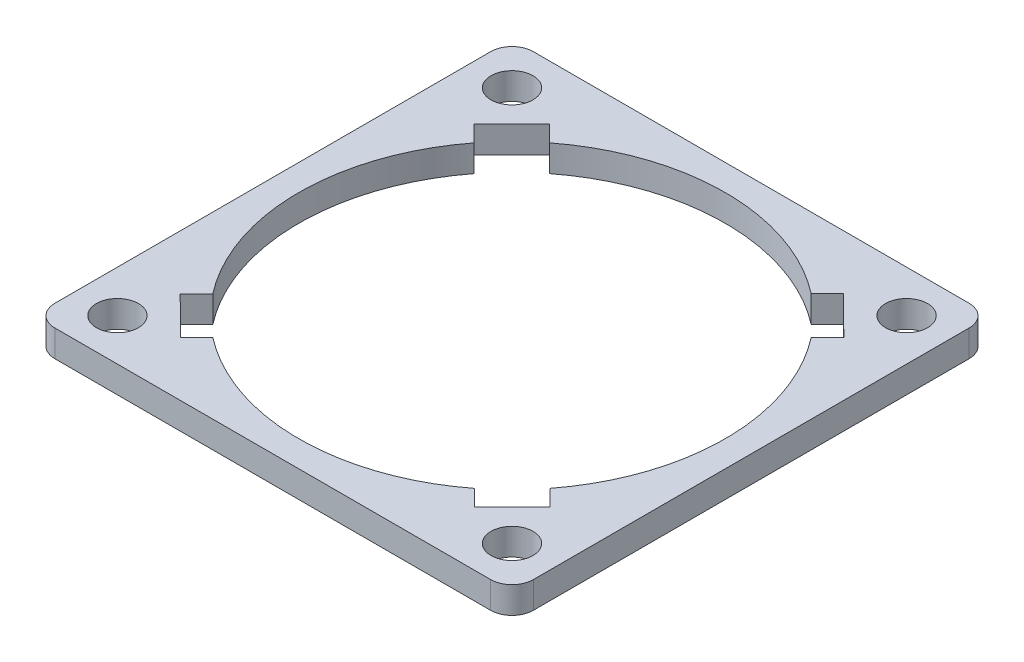
ISO-10303-21;
HEADER;
FILE_DESCRIPTION(('STEP AP214'),'2;1');
FILE_NAME('part.step','',(''),(''),'','','');
FILE_SCHEMA(('AUTOMOTIVE_DESIGN { 1 0 10303 214 1 1 1 1 }'));
ENDSEC;
DATA;
#1=APPLICATION_CONTEXT('core data for automotive mechanical design processes');
#2=APPLICATION_PROTOCOL_DEFINITION('international standard','automotive_design',2000,#1);
#3=PRODUCT_CONTEXT('',#1,'mechanical');
#4=PRODUCT('Part','Part','',(#3));
#5=PRODUCT_RELATED_PRODUCT_CATEGORY('part','',(#4));
#6=PRODUCT_DEFINITION_FORMATION('','',#4);
#7=PRODUCT_DEFINITION_CONTEXT('part definition',#1,'design');
#8=PRODUCT_DEFINITION('design','',#6,#7);
#9=PRODUCT_DEFINITION_SHAPE('','',#8);
#10=(LENGTH_UNIT() NAMED_UNIT(*) SI_UNIT(.MILLI.,.METRE.));
#11=(NAMED_UNIT(*) PLANE_ANGLE_UNIT() SI_UNIT($,.RADIAN.));
#12=(NAMED_UNIT(*) SI_UNIT($,.STERADIAN.) SOLID_ANGLE_UNIT());
#13=UNCERTAINTY_MEASURE_WITH_UNIT(LENGTH_MEASURE(1.E-05),#10,'distance_accuracy_value','');
#14=(GEOMETRIC_REPRESENTATION_CONTEXT(3) GLOBAL_UNCERTAINTY_ASSIGNED_CONTEXT((#13)) GLOBAL_UNIT_ASSIGNED_CONTEXT((#10,
#11,#12)) REPRESENTATION_CONTEXT('',''));
#15=CARTESIAN_POINT('',(0.,0.,0.));
#16=DIRECTION('',(0.,0.,1.));
#17=DIRECTION('',(1.,0.,0.));
#18=AXIS2_PLACEMENT_3D('',#15,#16,#17);
#19=CARTESIAN_POINT('',(25.9599938,3.175,-25.9599938));
#20=DIRECTION('',(0.,1.,0.));
#21=DIRECTION('',(0.,0.,1.));
#22=AXIS2_PLACEMENT_3D('',#19,#20,#21);
#23=PLANE('',#22);
#24=CARTESIAN_POINT('',(23.5000038000013,3.175,23.5000037999987));
#25=DIRECTION('',(0.,1.,0.));
#26=DIRECTION('',(0.,0.,1.));
#27=AXIS2_PLACEMENT_3D('',#24,#25,#26);
#28=CIRCLE('',#27,2.49999500000186);
#29=CARTESIAN_POINT('',(23.5000038000013,3.175,25.9999988000005));
#30=VERTEX_POINT('',#29);
#31=EDGE_CURVE('E535',#30,#30,#28,.T.);
#32=ORIENTED_EDGE('',*,*,#31,.F.);
#33=EDGE_LOOP('',(#32));
#34=FACE_BOUND('',#33,.T.);
#35=DIRECTION('',(-0.70756591619888,0.,-0.706647347857218));
#36=VECTOR('',#35,1.);
#37=CARTESIAN_POINT('',(-15.5876085360687,3.175,-20.0545870096165));
#38=LINE('',#37,#36);
#39=CARTESIAN_POINT('',(-15.5876085360687,3.175,-20.0545870096165));
#40=VERTEX_POINT('',#39);
#41=CARTESIAN_POINT('',(-17.52578636915,3.175,-21.9902486830621));
#42=VERTEX_POINT('',#41);
#43=EDGE_CURVE('E203',#40,#42,#38,.T.);
#44=ORIENTED_EDGE('',*,*,#43,.F.);
#45=CARTESIAN_POINT('',(0.,3.175,0.));
#46=DIRECTION('',(0.,1.,0.));
#47=DIRECTION('',(0.,0.,1.));
#48=AXIS2_PLACEMENT_3D('',#45,#46,#47);
#49=CIRCLE('',#48,25.4);
#50=CARTESIAN_POINT('',(15.5615434417537,3.175,-20.074819194962));
#51=VERTEX_POINT('',#50);
#52=EDGE_CURVE('E195',#51,#40,#49,.T.);
#53=ORIENTED_EDGE('',*,*,#52,.F.);
#54=DIRECTION('',(-0.706647347857219,0.,0.707565916198879));
#55=VECTOR('',#54,1.);
#56=CARTESIAN_POINT('',(15.5615434417537,3.175,-20.074819194962));
#57=LINE('',#56,#55);
#58=CARTESIAN_POINT('',(17.4972051151992,3.175,-22.0129970280433));
#59=VERTEX_POINT('',#58);
#60=EDGE_CURVE('E246',#59,#51,#57,.T.);
#61=ORIENTED_EDGE('',*,*,#60,.F.);
#62=DIRECTION('',(-0.707565916198878,0.,-0.706647347857219));
#63=VECTOR('',#62,1.);
#64=CARTESIAN_POINT('',(17.4972051151992,3.175,-22.0129970280433));
#65=LINE('',#64,#63);
#66=CARTESIAN_POINT('',(21.9902486830621,3.175,-17.52578636915));
#67=VERTEX_POINT('',#66);
#68=EDGE_CURVE('E244',#67,#59,#65,.T.);
#69=ORIENTED_EDGE('',*,*,#68,.F.);
#70=DIRECTION('',(0.70664734785722,0.,-0.707565916198878));
#71=VECTOR('',#70,1.);
#72=CARTESIAN_POINT('',(20.0545870096165,3.175,-15.5876085360686));
#73=LINE('',#72,#71);
#74=CARTESIAN_POINT('',(20.0545870096165,3.175,-15.5876085360686));
#75=VERTEX_POINT('',#74);
#76=EDGE_CURVE('E242',#75,#67,#73,.T.);
#77=ORIENTED_EDGE('',*,*,#76,.F.);
#78=CARTESIAN_POINT('',(0.,3.175,0.));
#79=DIRECTION('',(0.,1.,0.));
#80=DIRECTION('',(0.,0.,1.));
#81=AXIS2_PLACEMENT_3D('',#78,#79,#80);
#82=CIRCLE('',#81,25.4);
#83=CARTESIAN_POINT('',(20.074819194962,3.175,15.5615434417536));
#84=VERTEX_POINT('',#83);
#85=EDGE_CURVE('E240',#84,#75,#82,.T.);
#86=ORIENTED_EDGE('',*,*,#85,.F.);
#87=DIRECTION('',(-0.70756591619888,0.,-0.706647347857217));
#88=VECTOR('',#87,1.);
#89=CARTESIAN_POINT('',(22.0129970280433,3.175,17.4972051151992));
#90=LINE('',#89,#88);
#91=CARTESIAN_POINT('',(22.0129970280433,3.175,17.4972051151992));
#92=VERTEX_POINT('',#91);
#93=EDGE_CURVE('E238',#92,#84,#90,.T.);
#94=ORIENTED_EDGE('',*,*,#93,.F.);
#95=DIRECTION('',(0.706647347857218,0.,-0.70756591619888));
#96=VECTOR('',#95,1.);
#97=CARTESIAN_POINT('',(17.52578636915,3.175,21.9902486830621));
#98=LINE('',#97,#96);
#99=CARTESIAN_POINT('',(17.52578636915,3.175,21.9902486830621));
#100=VERTEX_POINT('',#99);
#101=EDGE_CURVE('E236',#100,#92,#98,.T.);
#102=ORIENTED_EDGE('',*,*,#101,.F.);
#103=DIRECTION('',(0.70756591619888,0.,0.706647347857218));
#104=VECTOR('',#103,1.);
#105=CARTESIAN_POINT('',(17.52578636915,3.175,21.9902486830621));
#106=LINE('',#105,#104);
#107=CARTESIAN_POINT('',(15.5876085360687,3.175,20.0545870096165));
#108=VERTEX_POINT('',#107);
#109=EDGE_CURVE('E234',#108,#100,#106,.T.);
#110=ORIENTED_EDGE('',*,*,#109,.F.);
#111=CARTESIAN_POINT('',(0.,3.175,0.));
#112=DIRECTION('',(0.,1.,0.));
#113=DIRECTION('',(0.,0.,1.));
#114=AXIS2_PLACEMENT_3D('',#111,#112,#113);
#115=CIRCLE('',#114,25.4);
#116=CARTESIAN_POINT('',(-15.5615434417537,3.175,20.074819194962));
#117=VERTEX_POINT('',#116);
#118=EDGE_CURVE('E232',#117,#108,#115,.T.);
#119=ORIENTED_EDGE('',*,*,#118,.F.);
#120=DIRECTION('',(0.706647347857219,0.,-0.707565916198879));
#121=VECTOR('',#120,1.);
#122=CARTESIAN_POINT('',(-17.4972051151993,3.175,22.0129970280433));
#123=LINE('',#122,#121);
#124=CARTESIAN_POINT('',(-17.4972051151993,3.175,22.0129970280433));
#125=VERTEX_POINT('',#124);
#126=EDGE_CURVE('E230',#125,#117,#123,.T.);
#127=ORIENTED_EDGE('',*,*,#126,.F.);
#128=DIRECTION('',(0.707565916198878,0.,0.70664734785722));
#129=VECTOR('',#128,1.);
#130=CARTESIAN_POINT('',(-21.9902486830621,3.175,17.5257863691499));
#131=LINE('',#130,#129);
#132=CARTESIAN_POINT('',(-21.9902486830621,3.175,17.5257863691499));
#133=VERTEX_POINT('',#132);
#134=EDGE_CURVE('E228',#133,#125,#131,.T.);
#135=ORIENTED_EDGE('',*,*,#134,.F.);
#136=DIRECTION('',(-0.70664734785722,0.,0.707565916198878));
#137=VECTOR('',#136,1.);
#138=CARTESIAN_POINT('',(-21.9902486830621,3.175,17.5257863691499));
#139=LINE('',#138,#137);
#140=CARTESIAN_POINT('',(-20.0545870096166,3.175,15.5876085360686));
#141=VERTEX_POINT('',#140);
#142=EDGE_CURVE('E226',#141,#133,#139,.T.);
#143=ORIENTED_EDGE('',*,*,#142,.F.);
#144=CARTESIAN_POINT('',(0.,3.175,0.));
#145=DIRECTION('',(0.,1.,0.));
#146=DIRECTION('',(0.,0.,1.));
#147=AXIS2_PLACEMENT_3D('',#144,#145,#146);
#148=CIRCLE('',#147,25.4);
#149=CARTESIAN_POINT('',(-20.074819194962,3.175,-15.5615434417536));
#150=VERTEX_POINT('',#149);
#151=EDGE_CURVE('E224',#150,#141,#148,.T.);
#152=ORIENTED_EDGE('',*,*,#151,.F.);
#153=DIRECTION('',(0.707565916198881,0.,0.706647347857217));
#154=VECTOR('',#153,1.);
#155=CARTESIAN_POINT('',(-20.074819194962,3.175,-15.5615434417536));
#156=LINE('',#155,#154);
#157=CARTESIAN_POINT('',(-22.0129970280434,3.175,-17.4972051151992));
#158=VERTEX_POINT('',#157);
#159=EDGE_CURVE('E219',#158,#150,#156,.T.);
#160=ORIENTED_EDGE('',*,*,#159,.F.);
#161=DIRECTION('',(-0.706647347857217,0.,0.70756591619888));
#162=VECTOR('',#161,1.);
#163=CARTESIAN_POINT('',(-22.0129970280434,3.175,-17.4972051151992));
#164=LINE('',#163,#162);
#165=EDGE_CURVE('E217',#42,#158,#164,.T.);
#166=ORIENTED_EDGE('',*,*,#165,.F.);
#167=EDGE_LOOP('',(#44,#53,#61,#69,#77,#86,#94,#102,#110,#119,#127,#135,#143,#152,#160,#166));
#168=FACE_BOUND('',#167,.T.);
#169=CARTESIAN_POINT('',(-23.5000038,3.175,-23.5000038));
#170=DIRECTION('',(0.,1.,0.));
#171=DIRECTION('',(0.,0.,1.));
#172=AXIS2_PLACEMENT_3D('',#169,#170,#171);
#173=CIRCLE('',#172,2.499995);
#174=CARTESIAN_POINT('',(-23.5000038,3.175,-21.0000088));
#175=VERTEX_POINT('',#174);
#176=EDGE_CURVE('E319',#175,#175,#173,.T.);
#177=ORIENTED_EDGE('',*,*,#176,.F.);
#178=EDGE_LOOP('',(#177));
#179=FACE_BOUND('',#178,.T.);
#180=DIRECTION('',(-1.,0.,0.));
#181=VECTOR('',#180,1.);
#182=CARTESIAN_POINT('',(-13.9933145966194,3.175,-28.4999938));
#183=LINE('',#182,#181);
#184=CARTESIAN_POINT('',(25.9599938,3.175,-28.4999938));
#185=VERTEX_POINT('',#184);
#186=CARTESIAN_POINT('',(-25.9599938,3.175,-28.4999938));
#187=VERTEX_POINT('',#186);
#188=EDGE_CURVE('E325',#185,#187,#183,.T.);
#189=ORIENTED_EDGE('',*,*,#188,.T.);
#190=CARTESIAN_POINT('',(-25.9599938,3.175,-25.9599938));
#191=DIRECTION('',(0.,1.,0.));
#192=DIRECTION('',(0.,0.,1.));
#193=AXIS2_PLACEMENT_3D('',#190,#191,#192);
#194=CIRCLE('',#193,2.54);
#195=CARTESIAN_POINT('',(-28.4999938,3.175,-25.9599938));
#196=VERTEX_POINT('',#195);
#197=EDGE_CURVE('E327',#187,#196,#194,.T.);
#198=ORIENTED_EDGE('',*,*,#197,.T.);
#199=DIRECTION('',(0.,0.,1.));
#200=VECTOR('',#199,1.);
#201=CARTESIAN_POINT('',(-28.4999938,3.175,-13.9933145966194));
#202=LINE('',#201,#200);
#203=CARTESIAN_POINT('',(-28.4999938,3.175,25.9599938));
#204=VERTEX_POINT('',#203);
#205=EDGE_CURVE('E330',#196,#204,#202,.T.);
#206=ORIENTED_EDGE('',*,*,#205,.T.);
#207=CARTESIAN_POINT('',(-25.9599938,3.175,25.9599938));
#208=DIRECTION('',(0.,1.,0.));
#209=DIRECTION('',(0.,0.,-1.));
#210=AXIS2_PLACEMENT_3D('',#207,#208,#209);
#211=CIRCLE('',#210,2.54);
#212=CARTESIAN_POINT('',(-25.9599938,3.175,28.4999938));
#213=VERTEX_POINT('',#212);
#214=EDGE_CURVE('E332',#204,#213,#211,.T.);
#215=ORIENTED_EDGE('',*,*,#214,.T.);
#216=DIRECTION('',(1.,0.,0.));
#217=VECTOR('',#216,1.);
#218=CARTESIAN_POINT('',(-13.9933145966194,3.175,28.4999938));
#219=LINE('',#218,#217);
#220=CARTESIAN_POINT('',(25.9599938,3.175,28.4999938));
#221=VERTEX_POINT('',#220);
#222=EDGE_CURVE('E334',#213,#221,#219,.T.);
#223=ORIENTED_EDGE('',*,*,#222,.T.);
#224=CARTESIAN_POINT('',(25.9599938,3.175,25.9599938));
#225=DIRECTION('',(0.,1.,0.));
#226=DIRECTION('',(0.,0.,1.));
#227=AXIS2_PLACEMENT_3D('',#224,#225,#226);
#228=CIRCLE('',#227,2.54);
#229=CARTESIAN_POINT('',(28.4999938,3.175,25.9599938));
#230=VERTEX_POINT('',#229);
#231=EDGE_CURVE('E336',#221,#230,#228,.T.);
#232=ORIENTED_EDGE('',*,*,#231,.T.);
#233=DIRECTION('',(0.,0.,-1.));
#234=VECTOR('',#233,1.);
#235=CARTESIAN_POINT('',(28.4999938,3.175,25.9599938));
#236=LINE('',#235,#234);
#237=CARTESIAN_POINT('',(28.4999938,3.175,-25.9599938));
#238=VERTEX_POINT('',#237);
#239=EDGE_CURVE('E338',#230,#238,#236,.T.);
#240=ORIENTED_EDGE('',*,*,#239,.T.);
#241=CARTESIAN_POINT('',(25.9599938,3.175,-25.9599938));
#242=DIRECTION('',(0.,1.,0.));
#243=DIRECTION('',(0.,0.,1.));
#244=AXIS2_PLACEMENT_3D('',#241,#242,#243);
#245=CIRCLE('',#244,2.54);
#246=EDGE_CURVE('E340',#238,#185,#245,.T.);
#247=ORIENTED_EDGE('',*,*,#246,.T.);
#248=EDGE_LOOP('',(#189,#198,#206,#215,#223,#232,#240,#247));
#249=FACE_BOUND('',#248,.T.);
#250=CARTESIAN_POINT('',(23.5000038,3.175,-23.5000038000013));
#251=DIRECTION('',(0.,1.,0.));
#252=DIRECTION('',(0.,0.,1.));
#253=AXIS2_PLACEMENT_3D('',#250,#251,#252);
#254=CIRCLE('',#253,2.49999500000137);
#255=CARTESIAN_POINT('',(23.5000038,3.175,-21.0000088));
#256=VERTEX_POINT('',#255);
#257=EDGE_CURVE('E249',#256,#256,#254,.T.);
#258=ORIENTED_EDGE('',*,*,#257,.F.);
#259=EDGE_LOOP('',(#258));
#260=FACE_BOUND('',#259,.T.);
#261=CARTESIAN_POINT('',(-23.5000037999987,3.175,23.5000038));
#262=DIRECTION('',(0.,1.,0.));
#263=DIRECTION('',(0.,0.,1.));
#264=AXIS2_PLACEMENT_3D('',#261,#262,#263);
#265=CIRCLE('',#264,2.49999500000069);
#266=CARTESIAN_POINT('',(-23.5000037999987,3.175,25.9999988000007));
#267=VERTEX_POINT('',#266);
#268=EDGE_CURVE('E526',#267,#267,#265,.T.);
#269=ORIENTED_EDGE('',*,*,#268,.F.);
#270=EDGE_LOOP('',(#269));
#271=FACE_BOUND('',#270,.T.);
#272=ADVANCED_FACE('F34',(#34,#168,#179,#249,#260,#271),#23,.T.);
#273=CARTESIAN_POINT('',(25.9599938,0.,-25.9599938));
#274=DIRECTION('',(0.,1.,0.));
#275=DIRECTION('',(0.,0.,1.));
#276=AXIS2_PLACEMENT_3D('',#273,#274,#275);
#277=PLANE('',#276);
#278=CARTESIAN_POINT('',(-23.5000038,0.,-23.5000038));
#279=DIRECTION('',(0.,1.,0.));
#280=DIRECTION('',(0.,0.,1.));
#281=AXIS2_PLACEMENT_3D('',#278,#279,#280);
#282=CIRCLE('',#281,2.499995);
#283=CARTESIAN_POINT('',(-23.5000038,0.,-21.0000088));
#284=VERTEX_POINT('',#283);
#285=EDGE_CURVE('E211',#284,#284,#282,.T.);
#286=ORIENTED_EDGE('',*,*,#285,.T.);
#287=EDGE_LOOP('',(#286));
#288=FACE_BOUND('',#287,.T.);
#289=CARTESIAN_POINT('',(-25.9599938,0.,-25.9599938));
#290=DIRECTION('',(0.,1.,0.));
#291=DIRECTION('',(0.,0.,1.));
#292=AXIS2_PLACEMENT_3D('',#289,#290,#291);
#293=CIRCLE('',#292,2.54);
#294=CARTESIAN_POINT('',(-25.9599938,0.,-28.4999938));
#295=VERTEX_POINT('',#294);
#296=CARTESIAN_POINT('',(-28.4999938,0.,-25.9599938));
#297=VERTEX_POINT('',#296);
#298=EDGE_CURVE('E322',#295,#297,#293,.T.);
#299=ORIENTED_EDGE('',*,*,#298,.F.);
#300=DIRECTION('',(-1.,0.,0.));
#301=VECTOR('',#300,1.);
#302=CARTESIAN_POINT('',(25.9599938,0.,-28.4999938));
#303=LINE('',#302,#301);
#304=CARTESIAN_POINT('',(25.9599938,0.,-28.4999938));
#305=VERTEX_POINT('',#304);
#306=EDGE_CURVE('E328',#305,#295,#303,.T.);
#307=ORIENTED_EDGE('',*,*,#306,.F.);
#308=CARTESIAN_POINT('',(25.9599938,0.,-25.9599938));
#309=DIRECTION('',(0.,1.,0.));
#310=DIRECTION('',(0.,0.,1.));
#311=AXIS2_PLACEMENT_3D('',#308,#309,#310);
#312=CIRCLE('',#311,2.54);
#313=CARTESIAN_POINT('',(28.4999938,0.,-25.9599938));
#314=VERTEX_POINT('',#313);
#315=EDGE_CURVE('E358',#314,#305,#312,.T.);
#316=ORIENTED_EDGE('',*,*,#315,.F.);
#317=DIRECTION('',(0.,0.,-1.));
#318=VECTOR('',#317,1.);
#319=CARTESIAN_POINT('',(28.4999938,0.,-13.9933145966194));
#320=LINE('',#319,#318);
#321=CARTESIAN_POINT('',(28.4999938,0.,25.9599938));
#322=VERTEX_POINT('',#321);
#323=EDGE_CURVE('E356',#322,#314,#320,.T.);
#324=ORIENTED_EDGE('',*,*,#323,.F.);
#325=CARTESIAN_POINT('',(25.9599938,0.,25.9599938));
#326=DIRECTION('',(0.,1.,0.));
#327=DIRECTION('',(0.,0.,1.));
#328=AXIS2_PLACEMENT_3D('',#325,#326,#327);
#329=CIRCLE('',#328,2.54);
#330=CARTESIAN_POINT('',(25.9599938,0.,28.4999938));
#331=VERTEX_POINT('',#330);
#332=EDGE_CURVE('E353',#331,#322,#329,.T.);
#333=ORIENTED_EDGE('',*,*,#332,.F.);
#334=DIRECTION('',(1.,0.,0.));
#335=VECTOR('',#334,1.);
#336=CARTESIAN_POINT('',(25.9599938,0.,28.4999938));
#337=LINE('',#336,#335);
#338=CARTESIAN_POINT('',(-25.9599938,0.,28.4999938));
#339=VERTEX_POINT('',#338);
#340=EDGE_CURVE('E351',#339,#331,#337,.T.);
#341=ORIENTED_EDGE('',*,*,#340,.F.);
#342=CARTESIAN_POINT('',(-25.9599938,0.,25.9599938));
#343=DIRECTION('',(0.,1.,0.));
#344=DIRECTION('',(0.,0.,-1.));
#345=AXIS2_PLACEMENT_3D('',#342,#343,#344);
#346=CIRCLE('',#345,2.54);
#347=CARTESIAN_POINT('',(-28.4999938,0.,25.9599938));
#348=VERTEX_POINT('',#347);
#349=EDGE_CURVE('E348',#348,#339,#346,.T.);
#350=ORIENTED_EDGE('',*,*,#349,.F.);
#351=DIRECTION('',(0.,0.,1.));
#352=VECTOR('',#351,1.);
#353=CARTESIAN_POINT('',(-28.4999938,0.,25.9599938));
#354=LINE('',#353,#352);
#355=EDGE_CURVE('E346',#297,#348,#354,.T.);
#356=ORIENTED_EDGE('',*,*,#355,.F.);
#357=EDGE_LOOP('',(#299,#307,#316,#324,#333,#341,#350,#356));
#358=FACE_BOUND('',#357,.T.);
#359=CARTESIAN_POINT('',(0.,0.,0.));
#360=DIRECTION('',(0.,1.,0.));
#361=DIRECTION('',(0.,0.,1.));
#362=AXIS2_PLACEMENT_3D('',#359,#360,#361);
#363=CIRCLE('',#362,25.4);
#364=CARTESIAN_POINT('',(15.5615434417537,0.,-20.074819194962));
#365=VERTEX_POINT('',#364);
#366=CARTESIAN_POINT('',(-15.5876085360687,0.,-20.0545870096165));
#367=VERTEX_POINT('',#366);
#368=EDGE_CURVE('E57',#365,#367,#363,.T.);
#369=ORIENTED_EDGE('',*,*,#368,.T.);
#370=DIRECTION('',(-0.70756591619888,0.,-0.706647347857218));
#371=VECTOR('',#370,1.);
#372=CARTESIAN_POINT('',(-15.5876085360687,0.,-20.0545870096165));
#373=LINE('',#372,#371);
#374=CARTESIAN_POINT('',(-17.52578636915,0.,-21.9902486830621));
#375=VERTEX_POINT('',#374);
#376=EDGE_CURVE('E210',#367,#375,#373,.T.);
#377=ORIENTED_EDGE('',*,*,#376,.T.);
#378=DIRECTION('',(-0.706647347857217,0.,0.70756591619888));
#379=VECTOR('',#378,1.);
#380=CARTESIAN_POINT('',(-22.0129970280434,0.,-17.4972051151992));
#381=LINE('',#380,#379);
#382=CARTESIAN_POINT('',(-22.0129970280434,0.,-17.4972051151992));
#383=VERTEX_POINT('',#382);
#384=EDGE_CURVE('E251',#375,#383,#381,.T.);
#385=ORIENTED_EDGE('',*,*,#384,.T.);
#386=DIRECTION('',(0.707565916198881,0.,0.706647347857217));
#387=VECTOR('',#386,1.);
#388=CARTESIAN_POINT('',(-20.074819194962,0.,-15.5615434417536));
#389=LINE('',#388,#387);
#390=CARTESIAN_POINT('',(-20.074819194962,0.,-15.5615434417536));
#391=VERTEX_POINT('',#390);
#392=EDGE_CURVE('E254',#383,#391,#389,.T.);
#393=ORIENTED_EDGE('',*,*,#392,.T.);
#394=CARTESIAN_POINT('',(0.,0.,0.));
#395=DIRECTION('',(0.,1.,0.));
#396=DIRECTION('',(0.,0.,1.));
#397=AXIS2_PLACEMENT_3D('',#394,#395,#396);
#398=CIRCLE('',#397,25.4);
#399=CARTESIAN_POINT('',(-20.0545870096166,0.,15.5876085360686));
#400=VERTEX_POINT('',#399);
#401=EDGE_CURVE('E257',#391,#400,#398,.T.);
#402=ORIENTED_EDGE('',*,*,#401,.T.);
#403=DIRECTION('',(-0.70664734785722,0.,0.707565916198878));
#404=VECTOR('',#403,1.);
#405=CARTESIAN_POINT('',(-21.9902486830621,0.,17.5257863691499));
#406=LINE('',#405,#404);
#407=CARTESIAN_POINT('',(-21.9902486830621,0.,17.5257863691499));
#408=VERTEX_POINT('',#407);
#409=EDGE_CURVE('E260',#400,#408,#406,.T.);
#410=ORIENTED_EDGE('',*,*,#409,.T.);
#411=DIRECTION('',(0.707565916198878,0.,0.70664734785722));
#412=VECTOR('',#411,1.);
#413=CARTESIAN_POINT('',(-21.9902486830621,0.,17.5257863691499));
#414=LINE('',#413,#412);
#415=CARTESIAN_POINT('',(-17.4972051151993,0.,22.0129970280433));
#416=VERTEX_POINT('',#415);
#417=EDGE_CURVE('E263',#408,#416,#414,.T.);
#418=ORIENTED_EDGE('',*,*,#417,.T.);
#419=DIRECTION('',(0.706647347857219,0.,-0.707565916198879));
#420=VECTOR('',#419,1.);
#421=CARTESIAN_POINT('',(-17.4972051151993,0.,22.0129970280433));
#422=LINE('',#421,#420);
#423=CARTESIAN_POINT('',(-15.5615434417537,0.,20.074819194962));
#424=VERTEX_POINT('',#423);
#425=EDGE_CURVE('E266',#416,#424,#422,.T.);
#426=ORIENTED_EDGE('',*,*,#425,.T.);
#427=CARTESIAN_POINT('',(0.,0.,0.));
#428=DIRECTION('',(0.,1.,0.));
#429=DIRECTION('',(0.,0.,1.));
#430=AXIS2_PLACEMENT_3D('',#427,#428,#429);
#431=CIRCLE('',#430,25.4);
#432=CARTESIAN_POINT('',(15.5876085360687,0.,20.0545870096165));
#433=VERTEX_POINT('',#432);
#434=EDGE_CURVE('E269',#424,#433,#431,.T.);
#435=ORIENTED_EDGE('',*,*,#434,.T.);
#436=DIRECTION('',(0.70756591619888,0.,0.706647347857218));
#437=VECTOR('',#436,1.);
#438=CARTESIAN_POINT('',(17.52578636915,0.,21.9902486830621));
#439=LINE('',#438,#437);
#440=CARTESIAN_POINT('',(17.52578636915,0.,21.9902486830621));
#441=VERTEX_POINT('',#440);
#442=EDGE_CURVE('E272',#433,#441,#439,.T.);
#443=ORIENTED_EDGE('',*,*,#442,.T.);
#444=DIRECTION('',(0.706647347857218,0.,-0.70756591619888));
#445=VECTOR('',#444,1.);
#446=CARTESIAN_POINT('',(17.52578636915,0.,21.9902486830621));
#447=LINE('',#446,#445);
#448=CARTESIAN_POINT('',(22.0129970280433,0.,17.4972051151992));
#449=VERTEX_POINT('',#448);
#450=EDGE_CURVE('E275',#441,#449,#447,.T.);
#451=ORIENTED_EDGE('',*,*,#450,.T.);
#452=DIRECTION('',(-0.70756591619888,0.,-0.706647347857217));
#453=VECTOR('',#452,1.);
#454=CARTESIAN_POINT('',(22.0129970280433,0.,17.4972051151992));
#455=LINE('',#454,#453);
#456=CARTESIAN_POINT('',(20.074819194962,0.,15.5615434417536));
#457=VERTEX_POINT('',#456);
#458=EDGE_CURVE('E278',#449,#457,#455,.T.);
#459=ORIENTED_EDGE('',*,*,#458,.T.);
#460=CARTESIAN_POINT('',(0.,0.,0.));
#461=DIRECTION('',(0.,1.,0.));
#462=DIRECTION('',(0.,0.,1.));
#463=AXIS2_PLACEMENT_3D('',#460,#461,#462);
#464=CIRCLE('',#463,25.4);
#465=CARTESIAN_POINT('',(20.0545870096165,0.,-15.5876085360686));
#466=VERTEX_POINT('',#465);
#467=EDGE_CURVE('E281',#457,#466,#464,.T.);
#468=ORIENTED_EDGE('',*,*,#467,.T.);
#469=DIRECTION('',(0.70664734785722,0.,-0.707565916198878));
#470=VECTOR('',#469,1.);
#471=CARTESIAN_POINT('',(20.0545870096165,0.,-15.5876085360686));
#472=LINE('',#471,#470);
#473=CARTESIAN_POINT('',(21.9902486830621,0.,-17.52578636915));
#474=VERTEX_POINT('',#473);
#475=EDGE_CURVE('E284',#466,#474,#472,.T.);
#476=ORIENTED_EDGE('',*,*,#475,.T.);
#477=DIRECTION('',(-0.707565916198878,0.,-0.706647347857219));
#478=VECTOR('',#477,1.);
#479=CARTESIAN_POINT('',(17.4972051151992,0.,-22.0129970280433));
#480=LINE('',#479,#478);
#481=CARTESIAN_POINT('',(17.4972051151992,0.,-22.0129970280433));
#482=VERTEX_POINT('',#481);
#483=EDGE_CURVE('E287',#474,#482,#480,.T.);
#484=ORIENTED_EDGE('',*,*,#483,.T.);
#485=DIRECTION('',(-0.706647347857219,0.,0.707565916198879));
#486=VECTOR('',#485,1.);
#487=CARTESIAN_POINT('',(15.5615434417537,0.,-20.074819194962));
#488=LINE('',#487,#486);
#489=EDGE_CURVE('E204',#482,#365,#488,.T.);
#490=ORIENTED_EDGE('',*,*,#489,.T.);
#491=EDGE_LOOP('',(#369,#377,#385,#393,#402,#410,#418,#426,#435,#443,#451,#459,#468,#476,#484,#490));
#492=FACE_BOUND('',#491,.T.);
#493=CARTESIAN_POINT('',(23.5000038,0.,-23.5000038000013));
#494=DIRECTION('',(0.,1.,0.));
#495=DIRECTION('',(0.,0.,1.));
#496=AXIS2_PLACEMENT_3D('',#493,#494,#495);
#497=CIRCLE('',#496,2.49999500000137);
#498=CARTESIAN_POINT('',(23.5000038,0.,-21.0000088));
#499=VERTEX_POINT('',#498);
#500=EDGE_CURVE('E538',#499,#499,#497,.T.);
#501=ORIENTED_EDGE('',*,*,#500,.T.);
#502=EDGE_LOOP('',(#501));
#503=FACE_BOUND('',#502,.T.);
#504=CARTESIAN_POINT('',(23.5000038000013,0.,23.5000037999987));
#505=DIRECTION('',(0.,1.,0.));
#506=DIRECTION('',(0.,0.,1.));
#507=AXIS2_PLACEMENT_3D('',#504,#505,#506);
#508=CIRCLE('',#507,2.49999500000186);
#509=CARTESIAN_POINT('',(23.5000038000013,0.,25.9999988000005));
#510=VERTEX_POINT('',#509);
#511=EDGE_CURVE('E532',#510,#510,#508,.T.);
#512=ORIENTED_EDGE('',*,*,#511,.T.);
#513=EDGE_LOOP('',(#512));
#514=FACE_BOUND('',#513,.T.);
#515=CARTESIAN_POINT('',(-23.5000037999987,0.,23.5000038));
#516=DIRECTION('',(0.,1.,0.));
#517=DIRECTION('',(0.,0.,1.));
#518=AXIS2_PLACEMENT_3D('',#515,#516,#517);
#519=CIRCLE('',#518,2.49999500000069);
#520=CARTESIAN_POINT('',(-23.5000037999987,0.,25.9999988000007));
#521=VERTEX_POINT('',#520);
#522=EDGE_CURVE('E529',#521,#521,#519,.T.);
#523=ORIENTED_EDGE('',*,*,#522,.T.);
#524=EDGE_LOOP('',(#523));
#525=FACE_BOUND('',#524,.T.);
#526=ADVANCED_FACE('F389',(#288,#358,#492,#503,#514,#525),#277,.F.);
#527=CARTESIAN_POINT('',(-25.9599938,3.175,-25.9599938));
#528=DIRECTION('',(0.,-1.,0.));
#529=DIRECTION('',(0.,0.,-1.));
#530=AXIS2_PLACEMENT_3D('',#527,#528,#529);
#531=CYLINDRICAL_SURFACE('',#530,2.54);
#532=ORIENTED_EDGE('',*,*,#298,.T.);
#533=DIRECTION('',(0.,-1.,0.));
#534=VECTOR('',#533,1.);
#535=CARTESIAN_POINT('',(-28.4999938,3.175,-25.9599938));
#536=LINE('',#535,#534);
#537=EDGE_CURVE('E42',#196,#297,#536,.T.);
#538=ORIENTED_EDGE('',*,*,#537,.F.);
#539=ORIENTED_EDGE('',*,*,#197,.F.);
#540=DIRECTION('',(0.,-1.,0.));
#541=VECTOR('',#540,1.);
#542=CARTESIAN_POINT('',(-25.9599938,3.175,-28.4999938));
#543=LINE('',#542,#541);
#544=EDGE_CURVE('E11',#187,#295,#543,.T.);
#545=ORIENTED_EDGE('',*,*,#544,.T.);
#546=EDGE_LOOP('',(#532,#538,#539,#545));
#547=FACE_BOUND('',#546,.T.);
#548=ADVANCED_FACE('F36',(#547),#531,.T.);
#549=CARTESIAN_POINT('',(-28.4999938,3.175,25.9599938));
#550=DIRECTION('',(1.,0.,0.));
#551=DIRECTION('',(0.,0.,-1.));
#552=AXIS2_PLACEMENT_3D('',#549,#550,#551);
#553=PLANE('',#552);
#554=ORIENTED_EDGE('',*,*,#355,.T.);
#555=DIRECTION('',(0.,-1.,0.));
#556=VECTOR('',#555,1.);
#557=CARTESIAN_POINT('',(-28.4999938,3.175,25.9599938));
#558=LINE('',#557,#556);
#559=EDGE_CURVE('E375',#204,#348,#558,.T.);
#560=ORIENTED_EDGE('',*,*,#559,.F.);
#561=ORIENTED_EDGE('',*,*,#205,.F.);
#562=ORIENTED_EDGE('',*,*,#537,.T.);
#563=EDGE_LOOP('',(#554,#560,#561,#562));
#564=FACE_BOUND('',#563,.T.);
#565=ADVANCED_FACE('F381',(#564),#553,.F.);
#566=CARTESIAN_POINT('',(-25.9599938,3.175,25.9599938));
#567=DIRECTION('',(0.,-1.,0.));
#568=DIRECTION('',(0.,0.,-1.));
#569=AXIS2_PLACEMENT_3D('',#566,#567,#568);
#570=CYLINDRICAL_SURFACE('',#569,2.54);
#571=ORIENTED_EDGE('',*,*,#349,.T.);
#572=DIRECTION('',(0.,-1.,0.));
#573=VECTOR('',#572,1.);
#574=CARTESIAN_POINT('',(-25.9599938,3.175,28.4999938));
#575=LINE('',#574,#573);
#576=EDGE_CURVE('E372',#213,#339,#575,.T.);
#577=ORIENTED_EDGE('',*,*,#576,.F.);
#578=ORIENTED_EDGE('',*,*,#214,.F.);
#579=ORIENTED_EDGE('',*,*,#559,.T.);
#580=EDGE_LOOP('',(#571,#577,#578,#579));
#581=FACE_BOUND('',#580,.T.);
#582=ADVANCED_FACE('F396',(#581),#570,.T.);
#583=CARTESIAN_POINT('',(25.9599938,3.175,28.4999938));
#584=DIRECTION('',(0.,0.,-1.));
#585=DIRECTION('',(-1.,0.,0.));
#586=AXIS2_PLACEMENT_3D('',#583,#584,#585);
#587=PLANE('',#586);
#588=ORIENTED_EDGE('',*,*,#340,.T.);
#589=DIRECTION('',(0.,-1.,0.));
#590=VECTOR('',#589,1.);
#591=CARTESIAN_POINT('',(25.9599938,3.175,28.4999938));
#592=LINE('',#591,#590);
#593=EDGE_CURVE('E369',#221,#331,#592,.T.);
#594=ORIENTED_EDGE('',*,*,#593,.F.);
#595=ORIENTED_EDGE('',*,*,#222,.F.);
#596=ORIENTED_EDGE('',*,*,#576,.T.);
#597=EDGE_LOOP('',(#588,#594,#595,#596));
#598=FACE_BOUND('',#597,.T.);
#599=ADVANCED_FACE('F400',(#598),#587,.F.);
#600=CARTESIAN_POINT('',(25.9599938,3.175,25.9599938));
#601=DIRECTION('',(0.,-1.,0.));
#602=DIRECTION('',(0.,0.,-1.));
#603=AXIS2_PLACEMENT_3D('',#600,#601,#602);
#604=CYLINDRICAL_SURFACE('',#603,2.54);
#605=ORIENTED_EDGE('',*,*,#332,.T.);
#606=DIRECTION('',(0.,-1.,0.));
#607=VECTOR('',#606,1.);
#608=CARTESIAN_POINT('',(28.4999938,3.175,25.9599938));
#609=LINE('',#608,#607);
#610=EDGE_CURVE('E366',#230,#322,#609,.T.);
#611=ORIENTED_EDGE('',*,*,#610,.F.);
#612=ORIENTED_EDGE('',*,*,#231,.F.);
#613=ORIENTED_EDGE('',*,*,#593,.T.);
#614=EDGE_LOOP('',(#605,#611,#612,#613));
#615=FACE_BOUND('',#614,.T.);
#616=ADVANCED_FACE('F415',(#615),#604,.T.);
#617=CARTESIAN_POINT('',(28.4999938,3.175,-13.9933145966194));
#618=DIRECTION('',(-1.,0.,0.));
#619=DIRECTION('',(0.,0.,1.));
#620=AXIS2_PLACEMENT_3D('',#617,#618,#619);
#621=PLANE('',#620);
#622=ORIENTED_EDGE('',*,*,#323,.T.);
#623=DIRECTION('',(0.,-1.,0.));
#624=VECTOR('',#623,1.);
#625=CARTESIAN_POINT('',(28.4999938,3.175,-25.9599938));
#626=LINE('',#625,#624);
#627=EDGE_CURVE('E363',#238,#314,#626,.T.);
#628=ORIENTED_EDGE('',*,*,#627,.F.);
#629=ORIENTED_EDGE('',*,*,#239,.F.);
#630=ORIENTED_EDGE('',*,*,#610,.T.);
#631=EDGE_LOOP('',(#622,#628,#629,#630));
#632=FACE_BOUND('',#631,.T.);
#633=ADVANCED_FACE('F417',(#632),#621,.F.);
#634=CARTESIAN_POINT('',(25.9599938,3.175,-25.9599938));
#635=DIRECTION('',(0.,-1.,0.));
#636=DIRECTION('',(0.,0.,-1.));
#637=AXIS2_PLACEMENT_3D('',#634,#635,#636);
#638=CYLINDRICAL_SURFACE('',#637,2.54);
#639=ORIENTED_EDGE('',*,*,#315,.T.);
#640=DIRECTION('',(0.,-1.,0.));
#641=VECTOR('',#640,1.);
#642=CARTESIAN_POINT('',(25.9599938,3.175,-28.4999938));
#643=LINE('',#642,#641);
#644=EDGE_CURVE('E343',#185,#305,#643,.T.);
#645=ORIENTED_EDGE('',*,*,#644,.F.);
#646=ORIENTED_EDGE('',*,*,#246,.F.);
#647=ORIENTED_EDGE('',*,*,#627,.T.);
#648=EDGE_LOOP('',(#639,#645,#646,#647));
#649=FACE_BOUND('',#648,.T.);
#650=ADVANCED_FACE('F411',(#649),#638,.T.);
#651=CARTESIAN_POINT('',(25.9599938,3.175,-28.4999938));
#652=DIRECTION('',(0.,0.,1.));
#653=DIRECTION('',(1.,0.,0.));
#654=AXIS2_PLACEMENT_3D('',#651,#652,#653);
#655=PLANE('',#654);
#656=ORIENTED_EDGE('',*,*,#306,.T.);
#657=ORIENTED_EDGE('',*,*,#544,.F.);
#658=ORIENTED_EDGE('',*,*,#188,.F.);
#659=ORIENTED_EDGE('',*,*,#644,.T.);
#660=EDGE_LOOP('',(#656,#657,#658,#659));
#661=FACE_BOUND('',#660,.T.);
#662=ADVANCED_FACE('F409',(#661),#655,.F.);
#663=CARTESIAN_POINT('',(-23.5000038,3.175,-23.5000038));
#664=DIRECTION('',(0.,-1.,0.));
#665=DIRECTION('',(0.,0.,-1.));
#666=AXIS2_PLACEMENT_3D('',#663,#664,#665);
#667=CYLINDRICAL_SURFACE('',#666,2.499995);
#668=ORIENTED_EDGE('',*,*,#176,.T.);
#669=EDGE_LOOP('',(#668));
#670=FACE_BOUND('',#669,.T.);
#671=ORIENTED_EDGE('',*,*,#285,.F.);
#672=EDGE_LOOP('',(#671));
#673=FACE_BOUND('',#672,.T.);
#674=ADVANCED_FACE('F436',(#670,#673),#667,.F.);
#675=CARTESIAN_POINT('',(0.,3.175,0.));
#676=DIRECTION('',(0.,-1.,0.));
#677=DIRECTION('',(0.,0.,-1.));
#678=AXIS2_PLACEMENT_3D('',#675,#676,#677);
#679=CYLINDRICAL_SURFACE('',#678,25.4);
#680=ORIENTED_EDGE('',*,*,#368,.F.);
#681=DIRECTION('',(0.,-1.,0.));
#682=VECTOR('',#681,1.);
#683=CARTESIAN_POINT('',(15.5615434417537,3.175,-20.074819194962));
#684=LINE('',#683,#682);
#685=EDGE_CURVE('E199',#51,#365,#684,.T.);
#686=ORIENTED_EDGE('',*,*,#685,.F.);
#687=ORIENTED_EDGE('',*,*,#52,.T.);
#688=DIRECTION('',(0.,-1.,0.));
#689=VECTOR('',#688,1.);
#690=CARTESIAN_POINT('',(-15.5876085360687,3.175,-20.0545870096165));
#691=LINE('',#690,#689);
#692=EDGE_CURVE('E198',#40,#367,#691,.T.);
#693=ORIENTED_EDGE('',*,*,#692,.T.);
#694=EDGE_LOOP('',(#680,#686,#687,#693));
#695=FACE_BOUND('',#694,.T.);
#696=ADVANCED_FACE('F197',(#695),#679,.F.);
#697=CARTESIAN_POINT('',(-15.5876085360687,3.175,-20.0545870096165));
#698=DIRECTION('',(-0.706647347857218,0.,0.70756591619888));
#699=DIRECTION('',(0.70756591619888,0.,0.706647347857218));
#700=AXIS2_PLACEMENT_3D('',#697,#698,#699);
#701=PLANE('',#700);
#702=ORIENTED_EDGE('',*,*,#376,.F.);
#703=ORIENTED_EDGE('',*,*,#692,.F.);
#704=ORIENTED_EDGE('',*,*,#43,.T.);
#705=DIRECTION('',(0.,-1.,0.));
#706=VECTOR('',#705,1.);
#707=CARTESIAN_POINT('',(-17.52578636915,3.175,-21.9902486830621));
#708=LINE('',#707,#706);
#709=EDGE_CURVE('E212',#42,#375,#708,.T.);
#710=ORIENTED_EDGE('',*,*,#709,.T.);
#711=EDGE_LOOP('',(#702,#703,#704,#710));
#712=FACE_BOUND('',#711,.T.);
#713=ADVANCED_FACE('F207',(#712),#701,.T.);
#714=CARTESIAN_POINT('',(-22.0129970280434,3.175,-17.4972051151992));
#715=DIRECTION('',(0.70756591619888,0.,0.706647347857217));
#716=DIRECTION('',(0.706647347857217,0.,-0.70756591619888));
#717=AXIS2_PLACEMENT_3D('',#714,#715,#716);
#718=PLANE('',#717);
#719=ORIENTED_EDGE('',*,*,#384,.F.);
#720=ORIENTED_EDGE('',*,*,#709,.F.);
#721=ORIENTED_EDGE('',*,*,#165,.T.);
#722=DIRECTION('',(0.,-1.,0.));
#723=VECTOR('',#722,1.);
#724=CARTESIAN_POINT('',(-22.0129970280434,3.175,-17.4972051151992));
#725=LINE('',#724,#723);
#726=EDGE_CURVE('E316',#158,#383,#725,.T.);
#727=ORIENTED_EDGE('',*,*,#726,.T.);
#728=EDGE_LOOP('',(#719,#720,#721,#727));
#729=FACE_BOUND('',#728,.T.);
#730=ADVANCED_FACE('F453',(#729),#718,.T.);
#731=CARTESIAN_POINT('',(-20.074819194962,3.175,-15.5615434417536));
#732=DIRECTION('',(0.706647347857217,0.,-0.707565916198881));
#733=DIRECTION('',(-0.707565916198881,0.,-0.706647347857217));
#734=AXIS2_PLACEMENT_3D('',#731,#732,#733);
#735=PLANE('',#734);
#736=ORIENTED_EDGE('',*,*,#392,.F.);
#737=ORIENTED_EDGE('',*,*,#726,.F.);
#738=ORIENTED_EDGE('',*,*,#159,.T.);
#739=DIRECTION('',(0.,-1.,0.));
#740=VECTOR('',#739,1.);
#741=CARTESIAN_POINT('',(-20.074819194962,3.175,-15.5615434417536));
#742=LINE('',#741,#740);
#743=EDGE_CURVE('E314',#150,#391,#742,.T.);
#744=ORIENTED_EDGE('',*,*,#743,.T.);
#745=EDGE_LOOP('',(#736,#737,#738,#744));
#746=FACE_BOUND('',#745,.T.);
#747=ADVANCED_FACE('F458',(#746),#735,.T.);
#748=CARTESIAN_POINT('',(0.,3.175,0.));
#749=DIRECTION('',(0.,-1.,0.));
#750=DIRECTION('',(0.,0.,-1.));
#751=AXIS2_PLACEMENT_3D('',#748,#749,#750);
#752=CYLINDRICAL_SURFACE('',#751,25.4);
#753=ORIENTED_EDGE('',*,*,#401,.F.);
#754=ORIENTED_EDGE('',*,*,#743,.F.);
#755=ORIENTED_EDGE('',*,*,#151,.T.);
#756=DIRECTION('',(0.,-1.,0.));
#757=VECTOR('',#756,1.);
#758=CARTESIAN_POINT('',(-20.0545870096166,3.175,15.5876085360686));
#759=LINE('',#758,#757);
#760=EDGE_CURVE('E312',#141,#400,#759,.T.);
#761=ORIENTED_EDGE('',*,*,#760,.T.);
#762=EDGE_LOOP('',(#753,#754,#755,#761));
#763=FACE_BOUND('',#762,.T.);
#764=ADVANCED_FACE('F462',(#763),#752,.F.);
#765=CARTESIAN_POINT('',(-21.9902486830621,3.175,17.5257863691499));
#766=DIRECTION('',(0.707565916198878,0.,0.70664734785722));
#767=DIRECTION('',(0.70664734785722,0.,-0.707565916198878));
#768=AXIS2_PLACEMENT_3D('',#765,#766,#767);
#769=PLANE('',#768);
#770=ORIENTED_EDGE('',*,*,#409,.F.);
#771=ORIENTED_EDGE('',*,*,#760,.F.);
#772=ORIENTED_EDGE('',*,*,#142,.T.);
#773=DIRECTION('',(0.,-1.,0.));
#774=VECTOR('',#773,1.);
#775=CARTESIAN_POINT('',(-21.9902486830621,3.175,17.5257863691499));
#776=LINE('',#775,#774);
#777=EDGE_CURVE('E310',#133,#408,#776,.T.);
#778=ORIENTED_EDGE('',*,*,#777,.T.);
#779=EDGE_LOOP('',(#770,#771,#772,#778));
#780=FACE_BOUND('',#779,.T.);
#781=ADVANCED_FACE('F466',(#780),#769,.T.);
#782=CARTESIAN_POINT('',(-21.9902486830621,3.175,17.5257863691499));
#783=DIRECTION('',(0.70664734785722,0.,-0.707565916198878));
#784=DIRECTION('',(-0.707565916198878,0.,-0.70664734785722));
#785=AXIS2_PLACEMENT_3D('',#782,#783,#784);
#786=PLANE('',#785);
#787=ORIENTED_EDGE('',*,*,#417,.F.);
#788=ORIENTED_EDGE('',*,*,#777,.F.);
#789=ORIENTED_EDGE('',*,*,#134,.T.);
#790=DIRECTION('',(0.,-1.,0.));
#791=VECTOR('',#790,1.);
#792=CARTESIAN_POINT('',(-17.4972051151993,3.175,22.0129970280433));
#793=LINE('',#792,#791);
#794=EDGE_CURVE('E308',#125,#416,#793,.T.);
#795=ORIENTED_EDGE('',*,*,#794,.T.);
#796=EDGE_LOOP('',(#787,#788,#789,#795));
#797=FACE_BOUND('',#796,.T.);
#798=ADVANCED_FACE('F470',(#797),#786,.T.);
#799=CARTESIAN_POINT('',(-17.4972051151993,3.175,22.0129970280433));
#800=DIRECTION('',(-0.707565916198879,0.,-0.706647347857219));
#801=DIRECTION('',(-0.706647347857219,0.,0.707565916198879));
#802=AXIS2_PLACEMENT_3D('',#799,#800,#801);
#803=PLANE('',#802);
#804=ORIENTED_EDGE('',*,*,#425,.F.);
#805=ORIENTED_EDGE('',*,*,#794,.F.);
#806=ORIENTED_EDGE('',*,*,#126,.T.);
#807=DIRECTION('',(0.,-1.,0.));
#808=VECTOR('',#807,1.);
#809=CARTESIAN_POINT('',(-15.5615434417537,3.175,20.074819194962));
#810=LINE('',#809,#808);
#811=EDGE_CURVE('E306',#117,#424,#810,.T.);
#812=ORIENTED_EDGE('',*,*,#811,.T.);
#813=EDGE_LOOP('',(#804,#805,#806,#812));
#814=FACE_BOUND('',#813,.T.);
#815=ADVANCED_FACE('F474',(#814),#803,.T.);
#816=CARTESIAN_POINT('',(0.,3.175,0.));
#817=DIRECTION('',(0.,-1.,0.));
#818=DIRECTION('',(0.,0.,-1.));
#819=AXIS2_PLACEMENT_3D('',#816,#817,#818);
#820=CYLINDRICAL_SURFACE('',#819,25.4);
#821=ORIENTED_EDGE('',*,*,#434,.F.);
#822=ORIENTED_EDGE('',*,*,#811,.F.);
#823=ORIENTED_EDGE('',*,*,#118,.T.);
#824=DIRECTION('',(0.,-1.,0.));
#825=VECTOR('',#824,1.);
#826=CARTESIAN_POINT('',(15.5876085360687,3.175,20.0545870096165));
#827=LINE('',#826,#825);
#828=EDGE_CURVE('E304',#108,#433,#827,.T.);
#829=ORIENTED_EDGE('',*,*,#828,.T.);
#830=EDGE_LOOP('',(#821,#822,#823,#829));
#831=FACE_BOUND('',#830,.T.);
#832=ADVANCED_FACE('F478',(#831),#820,.F.);
#833=CARTESIAN_POINT('',(17.52578636915,3.175,21.9902486830621));
#834=DIRECTION('',(0.706647347857218,0.,-0.70756591619888));
#835=DIRECTION('',(-0.70756591619888,0.,-0.706647347857218));
#836=AXIS2_PLACEMENT_3D('',#833,#834,#835);
#837=PLANE('',#836);
#838=ORIENTED_EDGE('',*,*,#442,.F.);
#839=ORIENTED_EDGE('',*,*,#828,.F.);
#840=ORIENTED_EDGE('',*,*,#109,.T.);
#841=DIRECTION('',(0.,-1.,0.));
#842=VECTOR('',#841,1.);
#843=CARTESIAN_POINT('',(17.52578636915,3.175,21.9902486830621));
#844=LINE('',#843,#842);
#845=EDGE_CURVE('E302',#100,#441,#844,.T.);
#846=ORIENTED_EDGE('',*,*,#845,.T.);
#847=EDGE_LOOP('',(#838,#839,#840,#846));
#848=FACE_BOUND('',#847,.T.);
#849=ADVANCED_FACE('F482',(#848),#837,.T.);
#850=CARTESIAN_POINT('',(17.52578636915,3.175,21.9902486830621));
#851=DIRECTION('',(-0.70756591619888,0.,-0.706647347857218));
#852=DIRECTION('',(-0.706647347857218,0.,0.70756591619888));
#853=AXIS2_PLACEMENT_3D('',#850,#851,#852);
#854=PLANE('',#853);
#855=ORIENTED_EDGE('',*,*,#450,.F.);
#856=ORIENTED_EDGE('',*,*,#845,.F.);
#857=ORIENTED_EDGE('',*,*,#101,.T.);
#858=DIRECTION('',(0.,-1.,0.));
#859=VECTOR('',#858,1.);
#860=CARTESIAN_POINT('',(22.0129970280433,3.175,17.4972051151992));
#861=LINE('',#860,#859);
#862=EDGE_CURVE('E300',#92,#449,#861,.T.);
#863=ORIENTED_EDGE('',*,*,#862,.T.);
#864=EDGE_LOOP('',(#855,#856,#857,#863));
#865=FACE_BOUND('',#864,.T.);
#866=ADVANCED_FACE('F486',(#865),#854,.T.);
#867=CARTESIAN_POINT('',(22.0129970280433,3.175,17.4972051151992));
#868=DIRECTION('',(-0.706647347857218,0.,0.70756591619888));
#869=DIRECTION('',(0.70756591619888,0.,0.706647347857218));
#870=AXIS2_PLACEMENT_3D('',#867,#868,#869);
#871=PLANE('',#870);
#872=ORIENTED_EDGE('',*,*,#458,.F.);
#873=ORIENTED_EDGE('',*,*,#862,.F.);
#874=ORIENTED_EDGE('',*,*,#93,.T.);
#875=DIRECTION('',(0.,-1.,0.));
#876=VECTOR('',#875,1.);
#877=CARTESIAN_POINT('',(20.074819194962,3.175,15.5615434417536));
#878=LINE('',#877,#876);
#879=EDGE_CURVE('E298',#84,#457,#878,.T.);
#880=ORIENTED_EDGE('',*,*,#879,.T.);
#881=EDGE_LOOP('',(#872,#873,#874,#880));
#882=FACE_BOUND('',#881,.T.);
#883=ADVANCED_FACE('F490',(#882),#871,.T.);
#884=CARTESIAN_POINT('',(0.,3.175,0.));
#885=DIRECTION('',(0.,-1.,0.));
#886=DIRECTION('',(0.,0.,-1.));
#887=AXIS2_PLACEMENT_3D('',#884,#885,#886);
#888=CYLINDRICAL_SURFACE('',#887,25.4);
#889=ORIENTED_EDGE('',*,*,#467,.F.);
#890=ORIENTED_EDGE('',*,*,#879,.F.);
#891=ORIENTED_EDGE('',*,*,#85,.T.);
#892=DIRECTION('',(0.,-1.,0.));
#893=VECTOR('',#892,1.);
#894=CARTESIAN_POINT('',(20.0545870096165,3.175,-15.5876085360686));
#895=LINE('',#894,#893);
#896=EDGE_CURVE('E296',#75,#466,#895,.T.);
#897=ORIENTED_EDGE('',*,*,#896,.T.);
#898=EDGE_LOOP('',(#889,#890,#891,#897));
#899=FACE_BOUND('',#898,.T.);
#900=ADVANCED_FACE('F494',(#899),#888,.F.);
#901=CARTESIAN_POINT('',(20.0545870096165,3.175,-15.5876085360686));
#902=DIRECTION('',(-0.707565916198878,0.,-0.70664734785722));
#903=DIRECTION('',(-0.70664734785722,0.,0.707565916198878));
#904=AXIS2_PLACEMENT_3D('',#901,#902,#903);
#905=PLANE('',#904);
#906=ORIENTED_EDGE('',*,*,#475,.F.);
#907=ORIENTED_EDGE('',*,*,#896,.F.);
#908=ORIENTED_EDGE('',*,*,#76,.T.);
#909=DIRECTION('',(0.,-1.,0.));
#910=VECTOR('',#909,1.);
#911=CARTESIAN_POINT('',(21.9902486830621,3.175,-17.52578636915));
#912=LINE('',#911,#910);
#913=EDGE_CURVE('E294',#67,#474,#912,.T.);
#914=ORIENTED_EDGE('',*,*,#913,.T.);
#915=EDGE_LOOP('',(#906,#907,#908,#914));
#916=FACE_BOUND('',#915,.T.);
#917=ADVANCED_FACE('F498',(#916),#905,.T.);
#918=CARTESIAN_POINT('',(17.4972051151992,3.175,-22.0129970280433));
#919=DIRECTION('',(-0.706647347857219,0.,0.707565916198878));
#920=DIRECTION('',(0.707565916198878,0.,0.706647347857219));
#921=AXIS2_PLACEMENT_3D('',#918,#919,#920);
#922=PLANE('',#921);
#923=ORIENTED_EDGE('',*,*,#483,.F.);
#924=ORIENTED_EDGE('',*,*,#913,.F.);
#925=ORIENTED_EDGE('',*,*,#68,.T.);
#926=DIRECTION('',(0.,-1.,0.));
#927=VECTOR('',#926,1.);
#928=CARTESIAN_POINT('',(17.4972051151992,3.175,-22.0129970280433));
#929=LINE('',#928,#927);
#930=EDGE_CURVE('E49',#59,#482,#929,.T.);
#931=ORIENTED_EDGE('',*,*,#930,.T.);
#932=EDGE_LOOP('',(#923,#924,#925,#931));
#933=FACE_BOUND('',#932,.T.);
#934=ADVANCED_FACE('F502',(#933),#922,.T.);
#935=CARTESIAN_POINT('',(15.5615434417537,3.175,-20.074819194962));
#936=DIRECTION('',(0.707565916198878,0.,0.706647347857219));
#937=DIRECTION('',(0.706647347857219,0.,-0.707565916198879));
#938=AXIS2_PLACEMENT_3D('',#935,#936,#937);
#939=PLANE('',#938);
#940=ORIENTED_EDGE('',*,*,#489,.F.);
#941=ORIENTED_EDGE('',*,*,#930,.F.);
#942=ORIENTED_EDGE('',*,*,#60,.T.);
#943=ORIENTED_EDGE('',*,*,#685,.T.);
#944=EDGE_LOOP('',(#940,#941,#942,#943));
#945=FACE_BOUND('',#944,.T.);
#946=ADVANCED_FACE('F506',(#945),#939,.T.);
#947=CARTESIAN_POINT('',(23.5000038,3.175,-23.5000038000013));
#948=DIRECTION('',(0.,-1.,0.));
#949=DIRECTION('',(0.,0.,-1.));
#950=AXIS2_PLACEMENT_3D('',#947,#948,#949);
#951=CYLINDRICAL_SURFACE('',#950,2.49999500000137);
#952=ORIENTED_EDGE('',*,*,#257,.T.);
#953=EDGE_LOOP('',(#952));
#954=FACE_BOUND('',#953,.T.);
#955=ORIENTED_EDGE('',*,*,#500,.F.);
#956=EDGE_LOOP('',(#955));
#957=FACE_BOUND('',#956,.T.);
#958=ADVANCED_FACE('F510',(#954,#957),#951,.F.);
#959=CARTESIAN_POINT('',(23.5000038000013,3.175,23.5000037999987));
#960=DIRECTION('',(0.,-1.,0.));
#961=DIRECTION('',(0.,0.,-1.));
#962=AXIS2_PLACEMENT_3D('',#959,#960,#961);
#963=CYLINDRICAL_SURFACE('',#962,2.49999500000186);
#964=ORIENTED_EDGE('',*,*,#31,.T.);
#965=EDGE_LOOP('',(#964));
#966=FACE_BOUND('',#965,.T.);
#967=ORIENTED_EDGE('',*,*,#511,.F.);
#968=EDGE_LOOP('',(#967));
#969=FACE_BOUND('',#968,.T.);
#970=ADVANCED_FACE('F513',(#966,#969),#963,.F.);
#971=CARTESIAN_POINT('',(-23.5000037999987,3.175,23.5000038));
#972=DIRECTION('',(0.,-1.,0.));
#973=DIRECTION('',(0.,0.,-1.));
#974=AXIS2_PLACEMENT_3D('',#971,#972,#973);
#975=CYLINDRICAL_SURFACE('',#974,2.49999500000069);
#976=ORIENTED_EDGE('',*,*,#268,.T.);
#977=EDGE_LOOP('',(#976));
#978=FACE_BOUND('',#977,.T.);
#979=ORIENTED_EDGE('',*,*,#522,.F.);
#980=EDGE_LOOP('',(#979));
#981=FACE_BOUND('',#980,.T.);
#982=ADVANCED_FACE('F517',(#978,#981),#975,.F.);
#983=CLOSED_SHELL('',(#272,#526,#548,#565,#582,#599,#616,#633,#650,#662,#674,#696,#713,#730,
#747,#764,#781,#798,#815,#832,#849,#866,#883,#900,#917,#934,#946,#958,#970,#982));
#984=MANIFOLD_SOLID_BREP('B2',#983);
#985=ADVANCED_BREP_SHAPE_REPRESENTATION('',(#18,#984),#14);
#986=SHAPE_DEFINITION_REPRESENTATION(#9,#985);
ENDSEC;
END-ISO-10303-21;
